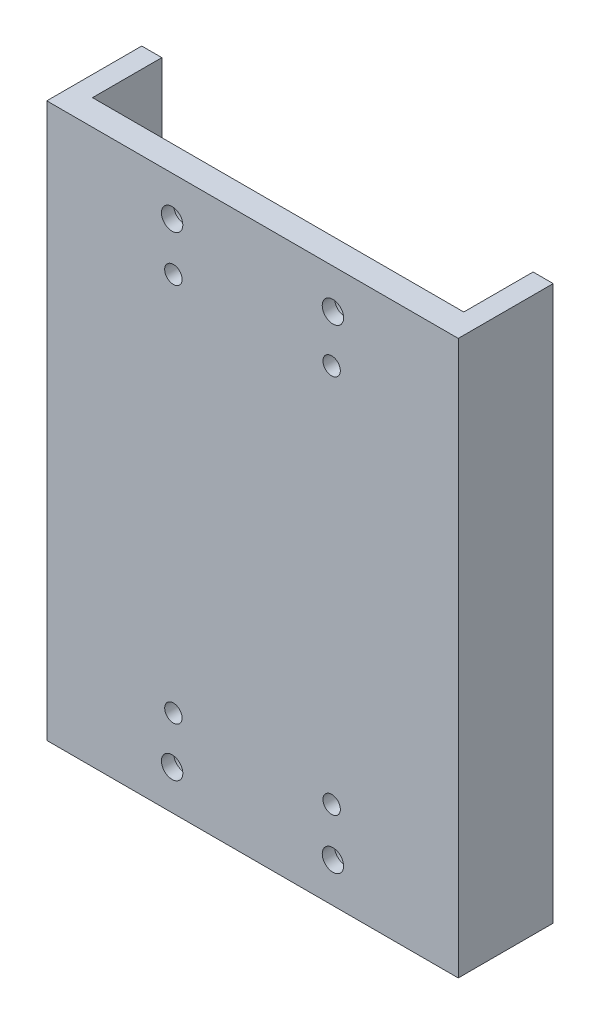
ISO-10303-21;
HEADER;
FILE_DESCRIPTION(('STEP AP214'),'2;1');
FILE_NAME('part.step','',(''),(''),'','','');
FILE_SCHEMA(('AUTOMOTIVE_DESIGN { 1 0 10303 214 1 1 1 1 }'));
ENDSEC;
DATA;
#1=APPLICATION_CONTEXT('core data for automotive mechanical design processes');
#2=APPLICATION_PROTOCOL_DEFINITION('international standard','automotive_design',2000,#1);
#3=PRODUCT_CONTEXT('',#1,'mechanical');
#4=PRODUCT('Part','Part','',(#3));
#5=PRODUCT_RELATED_PRODUCT_CATEGORY('part','',(#4));
#6=PRODUCT_DEFINITION_FORMATION('','',#4);
#7=PRODUCT_DEFINITION_CONTEXT('part definition',#1,'design');
#8=PRODUCT_DEFINITION('design','',#6,#7);
#9=PRODUCT_DEFINITION_SHAPE('','',#8);
#10=(LENGTH_UNIT() NAMED_UNIT(*) SI_UNIT(.MILLI.,.METRE.));
#11=(NAMED_UNIT(*) PLANE_ANGLE_UNIT() SI_UNIT($,.RADIAN.));
#12=(NAMED_UNIT(*) SI_UNIT($,.STERADIAN.) SOLID_ANGLE_UNIT());
#13=UNCERTAINTY_MEASURE_WITH_UNIT(LENGTH_MEASURE(1.E-05),#10,'distance_accuracy_value','');
#14=(GEOMETRIC_REPRESENTATION_CONTEXT(3) GLOBAL_UNCERTAINTY_ASSIGNED_CONTEXT((#13)) GLOBAL_UNIT_ASSIGNED_CONTEXT((#10,
#11,#12)) REPRESENTATION_CONTEXT('',''));
#15=CARTESIAN_POINT('',(0.,0.,0.));
#16=DIRECTION('',(0.,0.,1.));
#17=DIRECTION('',(1.,0.,0.));
#18=AXIS2_PLACEMENT_3D('',#15,#16,#17);
#19=CARTESIAN_POINT('',(-65.,87.5,0.));
#20=DIRECTION('',(1.,0.,0.));
#21=DIRECTION('',(0.,0.,-1.));
#22=AXIS2_PLACEMENT_3D('',#19,#20,#21);
#23=PLANE('',#22);
#24=DIRECTION('',(0.,0.,1.));
#25=VECTOR('',#24,1.);
#26=CARTESIAN_POINT('',(-65.,-87.5,0.));
#27=LINE('',#26,#25);
#28=CARTESIAN_POINT('',(-65.,-87.5,-30.));
#29=VERTEX_POINT('',#28);
#30=CARTESIAN_POINT('',(-65.,-87.5,0.));
#31=VERTEX_POINT('',#30);
#32=EDGE_CURVE('E128',#29,#31,#27,.T.);
#33=ORIENTED_EDGE('',*,*,#32,.T.);
#34=DIRECTION('',(0.,-1.,0.));
#35=VECTOR('',#34,1.);
#36=CARTESIAN_POINT('',(-65.,87.5,0.));
#37=LINE('',#36,#35);
#38=CARTESIAN_POINT('',(-65.,87.5,0.));
#39=VERTEX_POINT('',#38);
#40=EDGE_CURVE('E11',#39,#31,#37,.T.);
#41=ORIENTED_EDGE('',*,*,#40,.F.);
#42=DIRECTION('',(0.,0.,1.));
#43=VECTOR('',#42,1.);
#44=CARTESIAN_POINT('',(-65.,87.5,0.));
#45=LINE('',#44,#43);
#46=CARTESIAN_POINT('',(-65.,87.5,-30.));
#47=VERTEX_POINT('',#46);
#48=EDGE_CURVE('E143',#47,#39,#45,.T.);
#49=ORIENTED_EDGE('',*,*,#48,.F.);
#50=DIRECTION('',(0.,-1.,0.));
#51=VECTOR('',#50,1.);
#52=CARTESIAN_POINT('',(-65.,87.5,-30.));
#53=LINE('',#52,#51);
#54=EDGE_CURVE('E124',#47,#29,#53,.T.);
#55=ORIENTED_EDGE('',*,*,#54,.T.);
#56=EDGE_LOOP('',(#33,#41,#49,#55));
#57=FACE_BOUND('',#56,.T.);
#58=ADVANCED_FACE('F32',(#57),#23,.F.);
#59=CARTESIAN_POINT('',(-65.,87.5,0.));
#60=DIRECTION('',(0.,0.,-1.));
#61=DIRECTION('',(-1.,0.,0.));
#62=AXIS2_PLACEMENT_3D('',#59,#60,#61);
#63=PLANE('',#62);
#64=CARTESIAN_POINT('',(-25.,-60.,0.));
#65=DIRECTION('',(0.,0.,-1.));
#66=DIRECTION('',(-1.,0.,0.));
#67=AXIS2_PLACEMENT_3D('',#64,#65,#66);
#68=CIRCLE('',#67,2.75);
#69=CARTESIAN_POINT('',(-27.75,-60.,0.));
#70=VERTEX_POINT('',#69);
#71=EDGE_CURVE('E259',#70,#70,#68,.T.);
#72=ORIENTED_EDGE('',*,*,#71,.T.);
#73=EDGE_LOOP('',(#72));
#74=FACE_BOUND('',#73,.T.);
#75=CARTESIAN_POINT('',(25.,60.,0.));
#76=DIRECTION('',(0.,0.,-1.));
#77=DIRECTION('',(-1.,0.,0.));
#78=AXIS2_PLACEMENT_3D('',#75,#76,#77);
#79=CIRCLE('',#78,2.75);
#80=CARTESIAN_POINT('',(22.25,60.,0.));
#81=VERTEX_POINT('',#80);
#82=EDGE_CURVE('E247',#81,#81,#79,.T.);
#83=ORIENTED_EDGE('',*,*,#82,.T.);
#84=EDGE_LOOP('',(#83));
#85=FACE_BOUND('',#84,.T.);
#86=CARTESIAN_POINT('',(25.,-60.,0.));
#87=DIRECTION('',(0.,0.,-1.));
#88=DIRECTION('',(-1.,0.,0.));
#89=AXIS2_PLACEMENT_3D('',#86,#87,#88);
#90=CIRCLE('',#89,2.75);
#91=CARTESIAN_POINT('',(22.25,-60.,0.));
#92=VERTEX_POINT('',#91);
#93=EDGE_CURVE('E235',#92,#92,#90,.T.);
#94=ORIENTED_EDGE('',*,*,#93,.T.);
#95=EDGE_LOOP('',(#94));
#96=FACE_BOUND('',#95,.T.);
#97=CARTESIAN_POINT('',(-25.,60.,0.));
#98=DIRECTION('',(0.,0.,-1.));
#99=DIRECTION('',(-1.,0.,0.));
#100=AXIS2_PLACEMENT_3D('',#97,#98,#99);
#101=CIRCLE('',#100,2.75);
#102=CARTESIAN_POINT('',(-27.75,60.,0.));
#103=VERTEX_POINT('',#102);
#104=EDGE_CURVE('E223',#103,#103,#101,.T.);
#105=ORIENTED_EDGE('',*,*,#104,.T.);
#106=EDGE_LOOP('',(#105));
#107=FACE_BOUND('',#106,.T.);
#108=CARTESIAN_POINT('',(25.4,75.,0.));
#109=DIRECTION('',(0.,0.,-1.));
#110=DIRECTION('',(-1.,0.,0.));
#111=AXIS2_PLACEMENT_3D('',#108,#109,#110);
#112=CIRCLE('',#111,3.3782);
#113=CARTESIAN_POINT('',(22.0218,75.,0.));
#114=VERTEX_POINT('',#113);
#115=EDGE_CURVE('E211',#114,#114,#112,.T.);
#116=ORIENTED_EDGE('',*,*,#115,.T.);
#117=EDGE_LOOP('',(#116));
#118=FACE_BOUND('',#117,.T.);
#119=CARTESIAN_POINT('',(-25.4,-75.,0.));
#120=DIRECTION('',(0.,0.,-1.));
#121=DIRECTION('',(-1.,0.,0.));
#122=AXIS2_PLACEMENT_3D('',#119,#120,#121);
#123=CIRCLE('',#122,3.3782);
#124=CARTESIAN_POINT('',(-28.7782,-75.,0.));
#125=VERTEX_POINT('',#124);
#126=EDGE_CURVE('E199',#125,#125,#123,.T.);
#127=ORIENTED_EDGE('',*,*,#126,.T.);
#128=EDGE_LOOP('',(#127));
#129=FACE_BOUND('',#128,.T.);
#130=CARTESIAN_POINT('',(25.4,-75.,0.));
#131=DIRECTION('',(0.,0.,-1.));
#132=DIRECTION('',(-1.,0.,0.));
#133=AXIS2_PLACEMENT_3D('',#130,#131,#132);
#134=CIRCLE('',#133,3.3782);
#135=CARTESIAN_POINT('',(22.0218,-75.,0.));
#136=VERTEX_POINT('',#135);
#137=EDGE_CURVE('E187',#136,#136,#134,.T.);
#138=ORIENTED_EDGE('',*,*,#137,.T.);
#139=EDGE_LOOP('',(#138));
#140=FACE_BOUND('',#139,.T.);
#141=CARTESIAN_POINT('',(-25.4,75.,0.));
#142=DIRECTION('',(0.,0.,-1.));
#143=DIRECTION('',(-1.,0.,0.));
#144=AXIS2_PLACEMENT_3D('',#141,#142,#143);
#145=CIRCLE('',#144,3.3782);
#146=CARTESIAN_POINT('',(-28.7782,75.,0.));
#147=VERTEX_POINT('',#146);
#148=EDGE_CURVE('E132',#147,#147,#145,.T.);
#149=ORIENTED_EDGE('',*,*,#148,.T.);
#150=EDGE_LOOP('',(#149));
#151=FACE_BOUND('',#150,.T.);
#152=DIRECTION('',(1.,0.,0.));
#153=VECTOR('',#152,1.);
#154=CARTESIAN_POINT('',(-65.,-87.5,0.));
#155=LINE('',#154,#153);
#156=CARTESIAN_POINT('',(65.,-87.5,0.));
#157=VERTEX_POINT('',#156);
#158=EDGE_CURVE('E131',#31,#157,#155,.T.);
#159=ORIENTED_EDGE('',*,*,#158,.T.);
#160=DIRECTION('',(0.,-1.,0.));
#161=VECTOR('',#160,1.);
#162=CARTESIAN_POINT('',(65.,87.5,0.));
#163=LINE('',#162,#161);
#164=CARTESIAN_POINT('',(65.,87.5,0.));
#165=VERTEX_POINT('',#164);
#166=EDGE_CURVE('E40',#165,#157,#163,.T.);
#167=ORIENTED_EDGE('',*,*,#166,.F.);
#168=DIRECTION('',(1.,0.,0.));
#169=VECTOR('',#168,1.);
#170=CARTESIAN_POINT('',(-65.,87.5,0.));
#171=LINE('',#170,#169);
#172=EDGE_CURVE('E91',#39,#165,#171,.T.);
#173=ORIENTED_EDGE('',*,*,#172,.F.);
#174=ORIENTED_EDGE('',*,*,#40,.T.);
#175=EDGE_LOOP('',(#159,#167,#173,#174));
#176=FACE_BOUND('',#175,.T.);
#177=ADVANCED_FACE('F309',(#74,#85,#96,#107,#118,#129,#140,#151,#176),#63,.F.);
#178=CARTESIAN_POINT('',(65.,87.5,0.));
#179=DIRECTION('',(-1.,0.,0.));
#180=DIRECTION('',(0.,0.,1.));
#181=AXIS2_PLACEMENT_3D('',#178,#179,#180);
#182=PLANE('',#181);
#183=DIRECTION('',(0.,0.,-1.));
#184=VECTOR('',#183,1.);
#185=CARTESIAN_POINT('',(65.,-87.5,0.));
#186=LINE('',#185,#184);
#187=CARTESIAN_POINT('',(65.,-87.5,-30.));
#188=VERTEX_POINT('',#187);
#189=EDGE_CURVE('E134',#157,#188,#186,.T.);
#190=ORIENTED_EDGE('',*,*,#189,.T.);
#191=DIRECTION('',(0.,-1.,0.));
#192=VECTOR('',#191,1.);
#193=CARTESIAN_POINT('',(65.,87.5,-30.));
#194=LINE('',#193,#192);
#195=CARTESIAN_POINT('',(65.,87.5,-30.));
#196=VERTEX_POINT('',#195);
#197=EDGE_CURVE('E150',#196,#188,#194,.T.);
#198=ORIENTED_EDGE('',*,*,#197,.F.);
#199=DIRECTION('',(0.,0.,-1.));
#200=VECTOR('',#199,1.);
#201=CARTESIAN_POINT('',(65.,87.5,0.));
#202=LINE('',#201,#200);
#203=EDGE_CURVE('E158',#165,#196,#202,.T.);
#204=ORIENTED_EDGE('',*,*,#203,.F.);
#205=ORIENTED_EDGE('',*,*,#166,.T.);
#206=EDGE_LOOP('',(#190,#198,#204,#205));
#207=FACE_BOUND('',#206,.T.);
#208=ADVANCED_FACE('F156',(#207),#182,.F.);
#209=CARTESIAN_POINT('',(58.65,87.5,-30.));
#210=DIRECTION('',(0.,0.,1.));
#211=DIRECTION('',(1.,0.,0.));
#212=AXIS2_PLACEMENT_3D('',#209,#210,#211);
#213=PLANE('',#212);
#214=DIRECTION('',(-1.,0.,0.));
#215=VECTOR('',#214,1.);
#216=CARTESIAN_POINT('',(58.65,-87.5,-30.));
#217=LINE('',#216,#215);
#218=CARTESIAN_POINT('',(58.65,-87.5,-30.));
#219=VERTEX_POINT('',#218);
#220=EDGE_CURVE('E136',#188,#219,#217,.T.);
#221=ORIENTED_EDGE('',*,*,#220,.T.);
#222=DIRECTION('',(0.,-1.,0.));
#223=VECTOR('',#222,1.);
#224=CARTESIAN_POINT('',(58.65,87.5,-30.));
#225=LINE('',#224,#223);
#226=CARTESIAN_POINT('',(58.65,87.5,-30.));
#227=VERTEX_POINT('',#226);
#228=EDGE_CURVE('E147',#227,#219,#225,.T.);
#229=ORIENTED_EDGE('',*,*,#228,.F.);
#230=DIRECTION('',(-1.,0.,0.));
#231=VECTOR('',#230,1.);
#232=CARTESIAN_POINT('',(58.65,87.5,-30.));
#233=LINE('',#232,#231);
#234=EDGE_CURVE('E170',#196,#227,#233,.T.);
#235=ORIENTED_EDGE('',*,*,#234,.F.);
#236=ORIENTED_EDGE('',*,*,#197,.T.);
#237=EDGE_LOOP('',(#221,#229,#235,#236));
#238=FACE_BOUND('',#237,.T.);
#239=ADVANCED_FACE('F166',(#238),#213,.F.);
#240=CARTESIAN_POINT('',(58.65,87.5,-30.));
#241=DIRECTION('',(1.,0.,0.));
#242=DIRECTION('',(0.,0.,-1.));
#243=AXIS2_PLACEMENT_3D('',#240,#241,#242);
#244=PLANE('',#243);
#245=DIRECTION('',(0.,0.,1.));
#246=VECTOR('',#245,1.);
#247=CARTESIAN_POINT('',(58.65,-87.5,-30.));
#248=LINE('',#247,#246);
#249=CARTESIAN_POINT('',(58.65,-87.5,-8.09071729957804));
#250=VERTEX_POINT('',#249);
#251=EDGE_CURVE('E138',#219,#250,#248,.T.);
#252=ORIENTED_EDGE('',*,*,#251,.T.);
#253=DIRECTION('',(0.,-1.,0.));
#254=VECTOR('',#253,1.);
#255=CARTESIAN_POINT('',(58.65,87.5,-8.09071729957804));
#256=LINE('',#255,#254);
#257=CARTESIAN_POINT('',(58.65,87.5,-8.09071729957804));
#258=VERTEX_POINT('',#257);
#259=EDGE_CURVE('E119',#258,#250,#256,.T.);
#260=ORIENTED_EDGE('',*,*,#259,.F.);
#261=DIRECTION('',(0.,0.,1.));
#262=VECTOR('',#261,1.);
#263=CARTESIAN_POINT('',(58.65,87.5,-30.));
#264=LINE('',#263,#262);
#265=EDGE_CURVE('E110',#227,#258,#264,.T.);
#266=ORIENTED_EDGE('',*,*,#265,.F.);
#267=ORIENTED_EDGE('',*,*,#228,.T.);
#268=EDGE_LOOP('',(#252,#260,#266,#267));
#269=FACE_BOUND('',#268,.T.);
#270=ADVANCED_FACE('F169',(#269),#244,.F.);
#271=CARTESIAN_POINT('',(58.65,87.5,-8.09071729957804));
#272=DIRECTION('',(0.,0.,1.));
#273=DIRECTION('',(1.,0.,0.));
#274=AXIS2_PLACEMENT_3D('',#271,#272,#273);
#275=PLANE('',#274);
#276=CARTESIAN_POINT('',(-25.,-60.,-8.09071729957804));
#277=DIRECTION('',(0.,0.,-1.));
#278=DIRECTION('',(-1.,0.,0.));
#279=AXIS2_PLACEMENT_3D('',#276,#277,#278);
#280=CIRCLE('',#279,6.12);
#281=CARTESIAN_POINT('',(-31.12,-60.,-8.09071729957804));
#282=VERTEX_POINT('',#281);
#283=EDGE_CURVE('E268',#282,#282,#280,.T.);
#284=ORIENTED_EDGE('',*,*,#283,.F.);
#285=EDGE_LOOP('',(#284));
#286=FACE_BOUND('',#285,.T.);
#287=CARTESIAN_POINT('',(25.,60.,-8.09071729957804));
#288=DIRECTION('',(0.,0.,-1.));
#289=DIRECTION('',(-1.,0.,0.));
#290=AXIS2_PLACEMENT_3D('',#287,#288,#289);
#291=CIRCLE('',#290,6.12);
#292=CARTESIAN_POINT('',(18.88,60.,-8.09071729957804));
#293=VERTEX_POINT('',#292);
#294=EDGE_CURVE('E256',#293,#293,#291,.T.);
#295=ORIENTED_EDGE('',*,*,#294,.F.);
#296=EDGE_LOOP('',(#295));
#297=FACE_BOUND('',#296,.T.);
#298=CARTESIAN_POINT('',(25.,-60.,-8.09071729957804));
#299=DIRECTION('',(0.,0.,-1.));
#300=DIRECTION('',(-1.,0.,0.));
#301=AXIS2_PLACEMENT_3D('',#298,#299,#300);
#302=CIRCLE('',#301,6.12);
#303=CARTESIAN_POINT('',(18.88,-60.,-8.09071729957804));
#304=VERTEX_POINT('',#303);
#305=EDGE_CURVE('E244',#304,#304,#302,.T.);
#306=ORIENTED_EDGE('',*,*,#305,.F.);
#307=EDGE_LOOP('',(#306));
#308=FACE_BOUND('',#307,.T.);
#309=CARTESIAN_POINT('',(-25.,60.,-8.09071729957804));
#310=DIRECTION('',(0.,0.,-1.));
#311=DIRECTION('',(-1.,0.,0.));
#312=AXIS2_PLACEMENT_3D('',#309,#310,#311);
#313=CIRCLE('',#312,6.12);
#314=CARTESIAN_POINT('',(-31.12,60.,-8.09071729957804));
#315=VERTEX_POINT('',#314);
#316=EDGE_CURVE('E232',#315,#315,#313,.T.);
#317=ORIENTED_EDGE('',*,*,#316,.F.);
#318=EDGE_LOOP('',(#317));
#319=FACE_BOUND('',#318,.T.);
#320=CARTESIAN_POINT('',(25.4,75.,-8.09071729957804));
#321=DIRECTION('',(0.,0.,-1.));
#322=DIRECTION('',(-1.,0.,0.));
#323=AXIS2_PLACEMENT_3D('',#320,#321,#322);
#324=CIRCLE('',#323,7.14375);
#325=CARTESIAN_POINT('',(18.25625,75.,-8.09071729957804));
#326=VERTEX_POINT('',#325);
#327=EDGE_CURVE('E220',#326,#326,#324,.T.);
#328=ORIENTED_EDGE('',*,*,#327,.F.);
#329=EDGE_LOOP('',(#328));
#330=FACE_BOUND('',#329,.T.);
#331=CARTESIAN_POINT('',(-25.4,-75.,-8.09071729957804));
#332=DIRECTION('',(0.,0.,-1.));
#333=DIRECTION('',(-1.,0.,0.));
#334=AXIS2_PLACEMENT_3D('',#331,#332,#333);
#335=CIRCLE('',#334,7.14375);
#336=CARTESIAN_POINT('',(-32.54375,-75.,-8.09071729957804));
#337=VERTEX_POINT('',#336);
#338=EDGE_CURVE('E208',#337,#337,#335,.T.);
#339=ORIENTED_EDGE('',*,*,#338,.F.);
#340=EDGE_LOOP('',(#339));
#341=FACE_BOUND('',#340,.T.);
#342=CARTESIAN_POINT('',(25.4,-75.,-8.09071729957804));
#343=DIRECTION('',(0.,0.,-1.));
#344=DIRECTION('',(-1.,0.,0.));
#345=AXIS2_PLACEMENT_3D('',#342,#343,#344);
#346=CIRCLE('',#345,7.14375);
#347=CARTESIAN_POINT('',(18.25625,-75.,-8.09071729957804));
#348=VERTEX_POINT('',#347);
#349=EDGE_CURVE('E196',#348,#348,#346,.T.);
#350=ORIENTED_EDGE('',*,*,#349,.F.);
#351=EDGE_LOOP('',(#350));
#352=FACE_BOUND('',#351,.T.);
#353=CARTESIAN_POINT('',(-25.4,75.,-8.09071729957804));
#354=DIRECTION('',(0.,0.,-1.));
#355=DIRECTION('',(-1.,0.,0.));
#356=AXIS2_PLACEMENT_3D('',#353,#354,#355);
#357=CIRCLE('',#356,7.14375);
#358=CARTESIAN_POINT('',(-32.54375,75.,-8.09071729957804));
#359=VERTEX_POINT('',#358);
#360=EDGE_CURVE('E184',#359,#359,#357,.T.);
#361=ORIENTED_EDGE('',*,*,#360,.F.);
#362=EDGE_LOOP('',(#361));
#363=FACE_BOUND('',#362,.T.);
#364=DIRECTION('',(-1.,0.,0.));
#365=VECTOR('',#364,1.);
#366=CARTESIAN_POINT('',(58.65,-87.5,-8.09071729957804));
#367=LINE('',#366,#365);
#368=CARTESIAN_POINT('',(-58.65,-87.5,-8.09071729957804));
#369=VERTEX_POINT('',#368);
#370=EDGE_CURVE('E118',#250,#369,#367,.T.);
#371=ORIENTED_EDGE('',*,*,#370,.T.);
#372=DIRECTION('',(0.,-1.,0.));
#373=VECTOR('',#372,1.);
#374=CARTESIAN_POINT('',(-58.65,87.5,-8.09071729957804));
#375=LINE('',#374,#373);
#376=CARTESIAN_POINT('',(-58.65,87.5,-8.09071729957804));
#377=VERTEX_POINT('',#376);
#378=EDGE_CURVE('E115',#377,#369,#375,.T.);
#379=ORIENTED_EDGE('',*,*,#378,.F.);
#380=DIRECTION('',(-1.,0.,0.));
#381=VECTOR('',#380,1.);
#382=CARTESIAN_POINT('',(58.65,87.5,-8.09071729957804));
#383=LINE('',#382,#381);
#384=EDGE_CURVE('E104',#258,#377,#383,.T.);
#385=ORIENTED_EDGE('',*,*,#384,.F.);
#386=ORIENTED_EDGE('',*,*,#259,.T.);
#387=EDGE_LOOP('',(#371,#379,#385,#386));
#388=FACE_BOUND('',#387,.T.);
#389=ADVANCED_FACE('F116',(#286,#297,#308,#319,#330,#341,#352,#363,#388),#275,.F.);
#390=CARTESIAN_POINT('',(-58.65,87.5,-30.));
#391=DIRECTION('',(-1.,0.,0.));
#392=DIRECTION('',(0.,0.,1.));
#393=AXIS2_PLACEMENT_3D('',#390,#391,#392);
#394=PLANE('',#393);
#395=DIRECTION('',(0.,0.,-1.));
#396=VECTOR('',#395,1.);
#397=CARTESIAN_POINT('',(-58.65,-87.5,-30.));
#398=LINE('',#397,#396);
#399=CARTESIAN_POINT('',(-58.65,-87.5,-30.));
#400=VERTEX_POINT('',#399);
#401=EDGE_CURVE('E77',#369,#400,#398,.T.);
#402=ORIENTED_EDGE('',*,*,#401,.T.);
#403=DIRECTION('',(0.,-1.,0.));
#404=VECTOR('',#403,1.);
#405=CARTESIAN_POINT('',(-58.65,87.5,-30.));
#406=LINE('',#405,#404);
#407=CARTESIAN_POINT('',(-58.65,87.5,-30.));
#408=VERTEX_POINT('',#407);
#409=EDGE_CURVE('E120',#408,#400,#406,.T.);
#410=ORIENTED_EDGE('',*,*,#409,.F.);
#411=DIRECTION('',(0.,0.,-1.));
#412=VECTOR('',#411,1.);
#413=CARTESIAN_POINT('',(-58.65,87.5,-30.));
#414=LINE('',#413,#412);
#415=EDGE_CURVE('E108',#377,#408,#414,.T.);
#416=ORIENTED_EDGE('',*,*,#415,.F.);
#417=ORIENTED_EDGE('',*,*,#378,.T.);
#418=EDGE_LOOP('',(#402,#410,#416,#417));
#419=FACE_BOUND('',#418,.T.);
#420=ADVANCED_FACE('F122',(#419),#394,.F.);
#421=CARTESIAN_POINT('',(-65.,87.5,-30.));
#422=DIRECTION('',(0.,0.,1.));
#423=DIRECTION('',(1.,0.,0.));
#424=AXIS2_PLACEMENT_3D('',#421,#422,#423);
#425=PLANE('',#424);
#426=DIRECTION('',(-1.,0.,0.));
#427=VECTOR('',#426,1.);
#428=CARTESIAN_POINT('',(-65.,-87.5,-30.));
#429=LINE('',#428,#427);
#430=EDGE_CURVE('E83',#400,#29,#429,.T.);
#431=ORIENTED_EDGE('',*,*,#430,.T.);
#432=ORIENTED_EDGE('',*,*,#54,.F.);
#433=DIRECTION('',(-1.,0.,0.));
#434=VECTOR('',#433,1.);
#435=CARTESIAN_POINT('',(-65.,87.5,-30.));
#436=LINE('',#435,#434);
#437=EDGE_CURVE('E48',#408,#47,#436,.T.);
#438=ORIENTED_EDGE('',*,*,#437,.F.);
#439=ORIENTED_EDGE('',*,*,#409,.T.);
#440=EDGE_LOOP('',(#431,#432,#438,#439));
#441=FACE_BOUND('',#440,.T.);
#442=ADVANCED_FACE('F317',(#441),#425,.F.);
#443=CARTESIAN_POINT('',(0.,87.5,0.));
#444=DIRECTION('',(0.,-1.,0.));
#445=DIRECTION('',(0.,0.,-1.));
#446=AXIS2_PLACEMENT_3D('',#443,#444,#445);
#447=PLANE('',#446);
#448=ORIENTED_EDGE('',*,*,#48,.T.);
#449=ORIENTED_EDGE('',*,*,#172,.T.);
#450=ORIENTED_EDGE('',*,*,#203,.T.);
#451=ORIENTED_EDGE('',*,*,#234,.T.);
#452=ORIENTED_EDGE('',*,*,#265,.T.);
#453=ORIENTED_EDGE('',*,*,#384,.T.);
#454=ORIENTED_EDGE('',*,*,#415,.T.);
#455=ORIENTED_EDGE('',*,*,#437,.T.);
#456=EDGE_LOOP('',(#448,#449,#450,#451,#452,#453,#454,#455));
#457=FACE_BOUND('',#456,.T.);
#458=ADVANCED_FACE('F106',(#457),#447,.F.);
#459=CARTESIAN_POINT('',(0.,-87.5,0.));
#460=DIRECTION('',(0.,-1.,0.));
#461=DIRECTION('',(0.,0.,-1.));
#462=AXIS2_PLACEMENT_3D('',#459,#460,#461);
#463=PLANE('',#462);
#464=ORIENTED_EDGE('',*,*,#32,.F.);
#465=ORIENTED_EDGE('',*,*,#430,.F.);
#466=ORIENTED_EDGE('',*,*,#401,.F.);
#467=ORIENTED_EDGE('',*,*,#370,.F.);
#468=ORIENTED_EDGE('',*,*,#251,.F.);
#469=ORIENTED_EDGE('',*,*,#220,.F.);
#470=ORIENTED_EDGE('',*,*,#189,.F.);
#471=ORIENTED_EDGE('',*,*,#158,.F.);
#472=EDGE_LOOP('',(#464,#465,#466,#467,#468,#469,#470,#471));
#473=FACE_BOUND('',#472,.T.);
#474=ADVANCED_FACE('F162',(#473),#463,.T.);
#475=CARTESIAN_POINT('',(-25.4,75.,-8.09071729957804));
#476=DIRECTION('',(0.,0.,-1.));
#477=DIRECTION('',(-1.,0.,0.));
#478=AXIS2_PLACEMENT_3D('',#475,#476,#477);
#479=CYLINDRICAL_SURFACE('',#478,3.3782);
#480=ORIENTED_EDGE('',*,*,#148,.F.);
#481=EDGE_LOOP('',(#480));
#482=FACE_BOUND('',#481,.T.);
#483=CARTESIAN_POINT('',(-25.4,75.,-3.89971729957804));
#484=DIRECTION('',(0.,0.,-1.));
#485=DIRECTION('',(-1.,0.,0.));
#486=AXIS2_PLACEMENT_3D('',#483,#484,#485);
#487=CIRCLE('',#486,3.3782);
#488=CARTESIAN_POINT('',(-28.7782,75.,-3.89971729957804));
#489=VERTEX_POINT('',#488);
#490=EDGE_CURVE('E178',#489,#489,#487,.T.);
#491=ORIENTED_EDGE('',*,*,#490,.T.);
#492=EDGE_LOOP('',(#491));
#493=FACE_BOUND('',#492,.T.);
#494=ADVANCED_FACE('F304',(#482,#493),#479,.F.);
#495=CARTESIAN_POINT('',(-22.0218,75.,-3.89971729957804));
#496=DIRECTION('',(0.,0.,1.));
#497=DIRECTION('',(1.,0.,0.));
#498=AXIS2_PLACEMENT_3D('',#495,#496,#497);
#499=PLANE('',#498);
#500=ORIENTED_EDGE('',*,*,#490,.F.);
#501=EDGE_LOOP('',(#500));
#502=FACE_BOUND('',#501,.T.);
#503=CARTESIAN_POINT('',(-25.4,75.,-3.89971729957804));
#504=DIRECTION('',(0.,0.,-1.));
#505=DIRECTION('',(-1.,0.,0.));
#506=AXIS2_PLACEMENT_3D('',#503,#504,#505);
#507=CIRCLE('',#506,7.14375);
#508=CARTESIAN_POINT('',(-32.54375,75.,-3.89971729957804));
#509=VERTEX_POINT('',#508);
#510=EDGE_CURVE('E181',#509,#509,#507,.T.);
#511=ORIENTED_EDGE('',*,*,#510,.T.);
#512=EDGE_LOOP('',(#511));
#513=FACE_BOUND('',#512,.T.);
#514=ADVANCED_FACE('F294',(#502,#513),#499,.F.);
#515=CARTESIAN_POINT('',(-25.4,75.,-8.09071729957804));
#516=DIRECTION('',(0.,0.,-1.));
#517=DIRECTION('',(-1.,0.,0.));
#518=AXIS2_PLACEMENT_3D('',#515,#516,#517);
#519=CYLINDRICAL_SURFACE('',#518,7.14375);
#520=ORIENTED_EDGE('',*,*,#510,.F.);
#521=EDGE_LOOP('',(#520));
#522=FACE_BOUND('',#521,.T.);
#523=ORIENTED_EDGE('',*,*,#360,.T.);
#524=EDGE_LOOP('',(#523));
#525=FACE_BOUND('',#524,.T.);
#526=ADVANCED_FACE('F291',(#522,#525),#519,.F.);
#527=CARTESIAN_POINT('',(25.4,-75.,-8.09071729957804));
#528=DIRECTION('',(0.,0.,-1.));
#529=DIRECTION('',(-1.,0.,0.));
#530=AXIS2_PLACEMENT_3D('',#527,#528,#529);
#531=CYLINDRICAL_SURFACE('',#530,3.3782);
#532=ORIENTED_EDGE('',*,*,#137,.F.);
#533=EDGE_LOOP('',(#532));
#534=FACE_BOUND('',#533,.T.);
#535=CARTESIAN_POINT('',(25.4,-75.,-3.89971729957804));
#536=DIRECTION('',(0.,0.,-1.));
#537=DIRECTION('',(-1.,0.,0.));
#538=AXIS2_PLACEMENT_3D('',#535,#536,#537);
#539=CIRCLE('',#538,3.3782);
#540=CARTESIAN_POINT('',(22.0218,-75.,-3.89971729957804));
#541=VERTEX_POINT('',#540);
#542=EDGE_CURVE('E190',#541,#541,#539,.T.);
#543=ORIENTED_EDGE('',*,*,#542,.T.);
#544=EDGE_LOOP('',(#543));
#545=FACE_BOUND('',#544,.T.);
#546=ADVANCED_FACE('F293',(#534,#545),#531,.F.);
#547=CARTESIAN_POINT('',(28.7782,-75.,-3.89971729957804));
#548=DIRECTION('',(0.,0.,1.));
#549=DIRECTION('',(1.,0.,0.));
#550=AXIS2_PLACEMENT_3D('',#547,#548,#549);
#551=PLANE('',#550);
#552=ORIENTED_EDGE('',*,*,#542,.F.);
#553=EDGE_LOOP('',(#552));
#554=FACE_BOUND('',#553,.T.);
#555=CARTESIAN_POINT('',(25.4,-75.,-3.89971729957804));
#556=DIRECTION('',(0.,0.,-1.));
#557=DIRECTION('',(-1.,0.,0.));
#558=AXIS2_PLACEMENT_3D('',#555,#556,#557);
#559=CIRCLE('',#558,7.14375);
#560=CARTESIAN_POINT('',(18.25625,-75.,-3.89971729957804));
#561=VERTEX_POINT('',#560);
#562=EDGE_CURVE('E193',#561,#561,#559,.T.);
#563=ORIENTED_EDGE('',*,*,#562,.T.);
#564=EDGE_LOOP('',(#563));
#565=FACE_BOUND('',#564,.T.);
#566=ADVANCED_FACE('F301',(#554,#565),#551,.F.);
#567=CARTESIAN_POINT('',(25.4,-75.,-8.09071729957804));
#568=DIRECTION('',(0.,0.,-1.));
#569=DIRECTION('',(-1.,0.,0.));
#570=AXIS2_PLACEMENT_3D('',#567,#568,#569);
#571=CYLINDRICAL_SURFACE('',#570,7.14375);
#572=ORIENTED_EDGE('',*,*,#562,.F.);
#573=EDGE_LOOP('',(#572));
#574=FACE_BOUND('',#573,.T.);
#575=ORIENTED_EDGE('',*,*,#349,.T.);
#576=EDGE_LOOP('',(#575));
#577=FACE_BOUND('',#576,.T.);
#578=ADVANCED_FACE('F405',(#574,#577),#571,.F.);
#579=CARTESIAN_POINT('',(-25.4,-75.,-8.09071729957804));
#580=DIRECTION('',(0.,0.,-1.));
#581=DIRECTION('',(-1.,0.,0.));
#582=AXIS2_PLACEMENT_3D('',#579,#580,#581);
#583=CYLINDRICAL_SURFACE('',#582,3.3782);
#584=ORIENTED_EDGE('',*,*,#126,.F.);
#585=EDGE_LOOP('',(#584));
#586=FACE_BOUND('',#585,.T.);
#587=CARTESIAN_POINT('',(-25.4,-75.,-3.89971729957804));
#588=DIRECTION('',(0.,0.,-1.));
#589=DIRECTION('',(-1.,0.,0.));
#590=AXIS2_PLACEMENT_3D('',#587,#588,#589);
#591=CIRCLE('',#590,3.3782);
#592=CARTESIAN_POINT('',(-28.7782,-75.,-3.89971729957804));
#593=VERTEX_POINT('',#592);
#594=EDGE_CURVE('E202',#593,#593,#591,.T.);
#595=ORIENTED_EDGE('',*,*,#594,.T.);
#596=EDGE_LOOP('',(#595));
#597=FACE_BOUND('',#596,.T.);
#598=ADVANCED_FACE('F415',(#586,#597),#583,.F.);
#599=CARTESIAN_POINT('',(-22.0218,-75.,-3.89971729957804));
#600=DIRECTION('',(0.,0.,1.));
#601=DIRECTION('',(1.,0.,0.));
#602=AXIS2_PLACEMENT_3D('',#599,#600,#601);
#603=PLANE('',#602);
#604=ORIENTED_EDGE('',*,*,#594,.F.);
#605=EDGE_LOOP('',(#604));
#606=FACE_BOUND('',#605,.T.);
#607=CARTESIAN_POINT('',(-25.4,-75.,-3.89971729957804));
#608=DIRECTION('',(0.,0.,-1.));
#609=DIRECTION('',(-1.,0.,0.));
#610=AXIS2_PLACEMENT_3D('',#607,#608,#609);
#611=CIRCLE('',#610,7.14375);
#612=CARTESIAN_POINT('',(-32.54375,-75.,-3.89971729957804));
#613=VERTEX_POINT('',#612);
#614=EDGE_CURVE('E205',#613,#613,#611,.T.);
#615=ORIENTED_EDGE('',*,*,#614,.T.);
#616=EDGE_LOOP('',(#615));
#617=FACE_BOUND('',#616,.T.);
#618=ADVANCED_FACE('F425',(#606,#617),#603,.F.);
#619=CARTESIAN_POINT('',(-25.4,-75.,-8.09071729957804));
#620=DIRECTION('',(0.,0.,-1.));
#621=DIRECTION('',(-1.,0.,0.));
#622=AXIS2_PLACEMENT_3D('',#619,#620,#621);
#623=CYLINDRICAL_SURFACE('',#622,7.14375);
#624=ORIENTED_EDGE('',*,*,#614,.F.);
#625=EDGE_LOOP('',(#624));
#626=FACE_BOUND('',#625,.T.);
#627=ORIENTED_EDGE('',*,*,#338,.T.);
#628=EDGE_LOOP('',(#627));
#629=FACE_BOUND('',#628,.T.);
#630=ADVANCED_FACE('F435',(#626,#629),#623,.F.);
#631=CARTESIAN_POINT('',(25.4,75.,-8.09071729957804));
#632=DIRECTION('',(0.,0.,-1.));
#633=DIRECTION('',(-1.,0.,0.));
#634=AXIS2_PLACEMENT_3D('',#631,#632,#633);
#635=CYLINDRICAL_SURFACE('',#634,3.3782);
#636=ORIENTED_EDGE('',*,*,#115,.F.);
#637=EDGE_LOOP('',(#636));
#638=FACE_BOUND('',#637,.T.);
#639=CARTESIAN_POINT('',(25.4,75.,-3.89971729957804));
#640=DIRECTION('',(0.,0.,-1.));
#641=DIRECTION('',(-1.,0.,0.));
#642=AXIS2_PLACEMENT_3D('',#639,#640,#641);
#643=CIRCLE('',#642,3.3782);
#644=CARTESIAN_POINT('',(22.0218,75.,-3.89971729957804));
#645=VERTEX_POINT('',#644);
#646=EDGE_CURVE('E214',#645,#645,#643,.T.);
#647=ORIENTED_EDGE('',*,*,#646,.T.);
#648=EDGE_LOOP('',(#647));
#649=FACE_BOUND('',#648,.T.);
#650=ADVANCED_FACE('F445',(#638,#649),#635,.F.);
#651=CARTESIAN_POINT('',(28.7782,75.,-3.89971729957804));
#652=DIRECTION('',(0.,0.,1.));
#653=DIRECTION('',(1.,0.,0.));
#654=AXIS2_PLACEMENT_3D('',#651,#652,#653);
#655=PLANE('',#654);
#656=ORIENTED_EDGE('',*,*,#646,.F.);
#657=EDGE_LOOP('',(#656));
#658=FACE_BOUND('',#657,.T.);
#659=CARTESIAN_POINT('',(25.4,75.,-3.89971729957804));
#660=DIRECTION('',(0.,0.,-1.));
#661=DIRECTION('',(-1.,0.,0.));
#662=AXIS2_PLACEMENT_3D('',#659,#660,#661);
#663=CIRCLE('',#662,7.14375);
#664=CARTESIAN_POINT('',(18.25625,75.,-3.89971729957804));
#665=VERTEX_POINT('',#664);
#666=EDGE_CURVE('E217',#665,#665,#663,.T.);
#667=ORIENTED_EDGE('',*,*,#666,.T.);
#668=EDGE_LOOP('',(#667));
#669=FACE_BOUND('',#668,.T.);
#670=ADVANCED_FACE('F455',(#658,#669),#655,.F.);
#671=CARTESIAN_POINT('',(25.4,75.,-8.09071729957804));
#672=DIRECTION('',(0.,0.,-1.));
#673=DIRECTION('',(-1.,0.,0.));
#674=AXIS2_PLACEMENT_3D('',#671,#672,#673);
#675=CYLINDRICAL_SURFACE('',#674,7.14375);
#676=ORIENTED_EDGE('',*,*,#666,.F.);
#677=EDGE_LOOP('',(#676));
#678=FACE_BOUND('',#677,.T.);
#679=ORIENTED_EDGE('',*,*,#327,.T.);
#680=EDGE_LOOP('',(#679));
#681=FACE_BOUND('',#680,.T.);
#682=ADVANCED_FACE('F465',(#678,#681),#675,.F.);
#683=CARTESIAN_POINT('',(-25.,60.,-8.09071729957804));
#684=DIRECTION('',(0.,0.,-1.));
#685=DIRECTION('',(-1.,0.,0.));
#686=AXIS2_PLACEMENT_3D('',#683,#684,#685);
#687=CYLINDRICAL_SURFACE('',#686,2.75);
#688=ORIENTED_EDGE('',*,*,#104,.F.);
#689=EDGE_LOOP('',(#688));
#690=FACE_BOUND('',#689,.T.);
#691=CARTESIAN_POINT('',(-25.,60.,-4.51071729957804));
#692=DIRECTION('',(0.,0.,-1.));
#693=DIRECTION('',(-1.,0.,0.));
#694=AXIS2_PLACEMENT_3D('',#691,#692,#693);
#695=CIRCLE('',#694,2.75);
#696=CARTESIAN_POINT('',(-27.75,60.,-4.51071729957804));
#697=VERTEX_POINT('',#696);
#698=EDGE_CURVE('E226',#697,#697,#695,.T.);
#699=ORIENTED_EDGE('',*,*,#698,.T.);
#700=EDGE_LOOP('',(#699));
#701=FACE_BOUND('',#700,.T.);
#702=ADVANCED_FACE('F474',(#690,#701),#687,.F.);
#703=CARTESIAN_POINT('',(-22.25,60.,-4.51071729957804));
#704=DIRECTION('',(0.,0.,1.));
#705=DIRECTION('',(1.,0.,0.));
#706=AXIS2_PLACEMENT_3D('',#703,#704,#705);
#707=PLANE('',#706);
#708=ORIENTED_EDGE('',*,*,#698,.F.);
#709=EDGE_LOOP('',(#708));
#710=FACE_BOUND('',#709,.T.);
#711=CARTESIAN_POINT('',(-25.,60.,-4.51071729957804));
#712=DIRECTION('',(0.,0.,-1.));
#713=DIRECTION('',(-1.,0.,0.));
#714=AXIS2_PLACEMENT_3D('',#711,#712,#713);
#715=CIRCLE('',#714,6.12);
#716=CARTESIAN_POINT('',(-31.12,60.,-4.51071729957804));
#717=VERTEX_POINT('',#716);
#718=EDGE_CURVE('E229',#717,#717,#715,.T.);
#719=ORIENTED_EDGE('',*,*,#718,.T.);
#720=EDGE_LOOP('',(#719));
#721=FACE_BOUND('',#720,.T.);
#722=ADVANCED_FACE('F500',(#710,#721),#707,.F.);
#723=CARTESIAN_POINT('',(-25.,60.,-8.09071729957804));
#724=DIRECTION('',(0.,0.,-1.));
#725=DIRECTION('',(-1.,0.,0.));
#726=AXIS2_PLACEMENT_3D('',#723,#724,#725);
#727=CYLINDRICAL_SURFACE('',#726,6.12);
#728=ORIENTED_EDGE('',*,*,#718,.F.);
#729=EDGE_LOOP('',(#728));
#730=FACE_BOUND('',#729,.T.);
#731=ORIENTED_EDGE('',*,*,#316,.T.);
#732=EDGE_LOOP('',(#731));
#733=FACE_BOUND('',#732,.T.);
#734=ADVANCED_FACE('F507',(#730,#733),#727,.F.);
#735=CARTESIAN_POINT('',(25.,-60.,-8.09071729957804));
#736=DIRECTION('',(0.,0.,-1.));
#737=DIRECTION('',(-1.,0.,0.));
#738=AXIS2_PLACEMENT_3D('',#735,#736,#737);
#739=CYLINDRICAL_SURFACE('',#738,2.75);
#740=ORIENTED_EDGE('',*,*,#93,.F.);
#741=EDGE_LOOP('',(#740));
#742=FACE_BOUND('',#741,.T.);
#743=CARTESIAN_POINT('',(25.,-60.,-4.51071729957804));
#744=DIRECTION('',(0.,0.,-1.));
#745=DIRECTION('',(-1.,0.,0.));
#746=AXIS2_PLACEMENT_3D('',#743,#744,#745);
#747=CIRCLE('',#746,2.75);
#748=CARTESIAN_POINT('',(22.25,-60.,-4.51071729957804));
#749=VERTEX_POINT('',#748);
#750=EDGE_CURVE('E238',#749,#749,#747,.T.);
#751=ORIENTED_EDGE('',*,*,#750,.T.);
#752=EDGE_LOOP('',(#751));
#753=FACE_BOUND('',#752,.T.);
#754=ADVANCED_FACE('F515',(#742,#753),#739,.F.);
#755=CARTESIAN_POINT('',(27.75,-60.,-4.51071729957804));
#756=DIRECTION('',(0.,0.,1.));
#757=DIRECTION('',(1.,0.,0.));
#758=AXIS2_PLACEMENT_3D('',#755,#756,#757);
#759=PLANE('',#758);
#760=ORIENTED_EDGE('',*,*,#750,.F.);
#761=EDGE_LOOP('',(#760));
#762=FACE_BOUND('',#761,.T.);
#763=CARTESIAN_POINT('',(25.,-60.,-4.51071729957804));
#764=DIRECTION('',(0.,0.,-1.));
#765=DIRECTION('',(-1.,0.,0.));
#766=AXIS2_PLACEMENT_3D('',#763,#764,#765);
#767=CIRCLE('',#766,6.12);
#768=CARTESIAN_POINT('',(18.88,-60.,-4.51071729957804));
#769=VERTEX_POINT('',#768);
#770=EDGE_CURVE('E241',#769,#769,#767,.T.);
#771=ORIENTED_EDGE('',*,*,#770,.T.);
#772=EDGE_LOOP('',(#771));
#773=FACE_BOUND('',#772,.T.);
#774=ADVANCED_FACE('F523',(#762,#773),#759,.F.);
#775=CARTESIAN_POINT('',(25.,-60.,-8.09071729957804));
#776=DIRECTION('',(0.,0.,-1.));
#777=DIRECTION('',(-1.,0.,0.));
#778=AXIS2_PLACEMENT_3D('',#775,#776,#777);
#779=CYLINDRICAL_SURFACE('',#778,6.12);
#780=ORIENTED_EDGE('',*,*,#770,.F.);
#781=EDGE_LOOP('',(#780));
#782=FACE_BOUND('',#781,.T.);
#783=ORIENTED_EDGE('',*,*,#305,.T.);
#784=EDGE_LOOP('',(#783));
#785=FACE_BOUND('',#784,.T.);
#786=ADVANCED_FACE('F531',(#782,#785),#779,.F.);
#787=CARTESIAN_POINT('',(25.,60.,-8.09071729957804));
#788=DIRECTION('',(0.,0.,-1.));
#789=DIRECTION('',(-1.,0.,0.));
#790=AXIS2_PLACEMENT_3D('',#787,#788,#789);
#791=CYLINDRICAL_SURFACE('',#790,2.75);
#792=ORIENTED_EDGE('',*,*,#82,.F.);
#793=EDGE_LOOP('',(#792));
#794=FACE_BOUND('',#793,.T.);
#795=CARTESIAN_POINT('',(25.,60.,-4.51071729957804));
#796=DIRECTION('',(0.,0.,-1.));
#797=DIRECTION('',(-1.,0.,0.));
#798=AXIS2_PLACEMENT_3D('',#795,#796,#797);
#799=CIRCLE('',#798,2.75);
#800=CARTESIAN_POINT('',(22.25,60.,-4.51071729957804));
#801=VERTEX_POINT('',#800);
#802=EDGE_CURVE('E250',#801,#801,#799,.T.);
#803=ORIENTED_EDGE('',*,*,#802,.T.);
#804=EDGE_LOOP('',(#803));
#805=FACE_BOUND('',#804,.T.);
#806=ADVANCED_FACE('F539',(#794,#805),#791,.F.);
#807=CARTESIAN_POINT('',(27.75,60.,-4.51071729957804));
#808=DIRECTION('',(0.,0.,1.));
#809=DIRECTION('',(1.,0.,0.));
#810=AXIS2_PLACEMENT_3D('',#807,#808,#809);
#811=PLANE('',#810);
#812=ORIENTED_EDGE('',*,*,#802,.F.);
#813=EDGE_LOOP('',(#812));
#814=FACE_BOUND('',#813,.T.);
#815=CARTESIAN_POINT('',(25.,60.,-4.51071729957804));
#816=DIRECTION('',(0.,0.,-1.));
#817=DIRECTION('',(-1.,0.,0.));
#818=AXIS2_PLACEMENT_3D('',#815,#816,#817);
#819=CIRCLE('',#818,6.12);
#820=CARTESIAN_POINT('',(18.88,60.,-4.51071729957804));
#821=VERTEX_POINT('',#820);
#822=EDGE_CURVE('E253',#821,#821,#819,.T.);
#823=ORIENTED_EDGE('',*,*,#822,.T.);
#824=EDGE_LOOP('',(#823));
#825=FACE_BOUND('',#824,.T.);
#826=ADVANCED_FACE('F547',(#814,#825),#811,.F.);
#827=CARTESIAN_POINT('',(25.,60.,-8.09071729957804));
#828=DIRECTION('',(0.,0.,-1.));
#829=DIRECTION('',(-1.,0.,0.));
#830=AXIS2_PLACEMENT_3D('',#827,#828,#829);
#831=CYLINDRICAL_SURFACE('',#830,6.12);
#832=ORIENTED_EDGE('',*,*,#822,.F.);
#833=EDGE_LOOP('',(#832));
#834=FACE_BOUND('',#833,.T.);
#835=ORIENTED_EDGE('',*,*,#294,.T.);
#836=EDGE_LOOP('',(#835));
#837=FACE_BOUND('',#836,.T.);
#838=ADVANCED_FACE('F555',(#834,#837),#831,.F.);
#839=CARTESIAN_POINT('',(-25.,-60.,-8.09071729957804));
#840=DIRECTION('',(0.,0.,-1.));
#841=DIRECTION('',(-1.,0.,0.));
#842=AXIS2_PLACEMENT_3D('',#839,#840,#841);
#843=CYLINDRICAL_SURFACE('',#842,2.75);
#844=ORIENTED_EDGE('',*,*,#71,.F.);
#845=EDGE_LOOP('',(#844));
#846=FACE_BOUND('',#845,.T.);
#847=CARTESIAN_POINT('',(-25.,-60.,-4.51071729957804));
#848=DIRECTION('',(0.,0.,-1.));
#849=DIRECTION('',(-1.,0.,0.));
#850=AXIS2_PLACEMENT_3D('',#847,#848,#849);
#851=CIRCLE('',#850,2.75);
#852=CARTESIAN_POINT('',(-27.75,-60.,-4.51071729957804));
#853=VERTEX_POINT('',#852);
#854=EDGE_CURVE('E262',#853,#853,#851,.T.);
#855=ORIENTED_EDGE('',*,*,#854,.T.);
#856=EDGE_LOOP('',(#855));
#857=FACE_BOUND('',#856,.T.);
#858=ADVANCED_FACE('F563',(#846,#857),#843,.F.);
#859=CARTESIAN_POINT('',(-22.25,-60.,-4.51071729957804));
#860=DIRECTION('',(0.,0.,1.));
#861=DIRECTION('',(1.,0.,0.));
#862=AXIS2_PLACEMENT_3D('',#859,#860,#861);
#863=PLANE('',#862);
#864=ORIENTED_EDGE('',*,*,#854,.F.);
#865=EDGE_LOOP('',(#864));
#866=FACE_BOUND('',#865,.T.);
#867=CARTESIAN_POINT('',(-25.,-60.,-4.51071729957804));
#868=DIRECTION('',(0.,0.,-1.));
#869=DIRECTION('',(-1.,0.,0.));
#870=AXIS2_PLACEMENT_3D('',#867,#868,#869);
#871=CIRCLE('',#870,6.12);
#872=CARTESIAN_POINT('',(-31.12,-60.,-4.51071729957804));
#873=VERTEX_POINT('',#872);
#874=EDGE_CURVE('E265',#873,#873,#871,.T.);
#875=ORIENTED_EDGE('',*,*,#874,.T.);
#876=EDGE_LOOP('',(#875));
#877=FACE_BOUND('',#876,.T.);
#878=ADVANCED_FACE('F571',(#866,#877),#863,.F.);
#879=CARTESIAN_POINT('',(-25.,-60.,-8.09071729957804));
#880=DIRECTION('',(0.,0.,-1.));
#881=DIRECTION('',(-1.,0.,0.));
#882=AXIS2_PLACEMENT_3D('',#879,#880,#881);
#883=CYLINDRICAL_SURFACE('',#882,6.12);
#884=ORIENTED_EDGE('',*,*,#874,.F.);
#885=EDGE_LOOP('',(#884));
#886=FACE_BOUND('',#885,.T.);
#887=ORIENTED_EDGE('',*,*,#283,.T.);
#888=EDGE_LOOP('',(#887));
#889=FACE_BOUND('',#888,.T.);
#890=ADVANCED_FACE('F272',(#886,#889),#883,.F.);
#891=CLOSED_SHELL('',(#58,#177,#208,#239,#270,#389,#420,#442,#458,#474,#494,#514,#526,#546,#566,
#578,#598,#618,#630,#650,#670,#682,#702,#722,#734,#754,#774,#786,#806,#826,#838,#858,#878,#890));
#892=MANIFOLD_SOLID_BREP('B2',#891);
#893=ADVANCED_BREP_SHAPE_REPRESENTATION('',(#18,#892),#14);
#894=SHAPE_DEFINITION_REPRESENTATION(#9,#893);
ENDSEC;
END-ISO-10303-21;
